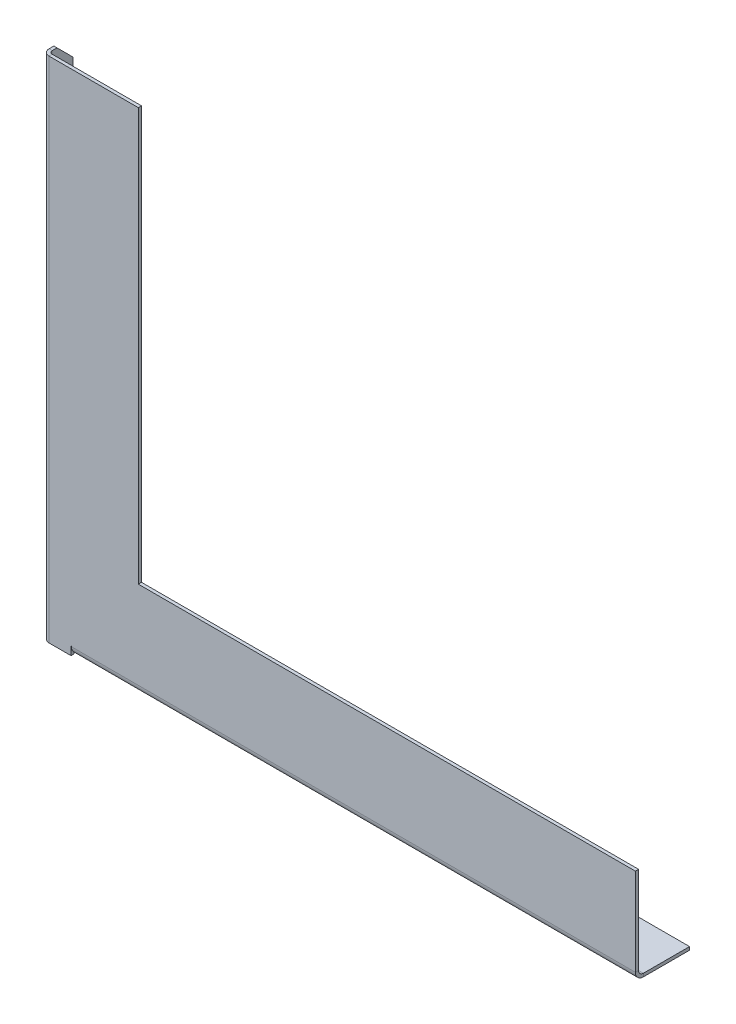
ISO-10303-21;
HEADER;
FILE_DESCRIPTION(('STEP AP214'),'2;1');
FILE_NAME('part.step','',(''),(''),'','','');
FILE_SCHEMA(('AUTOMOTIVE_DESIGN { 1 0 10303 214 1 1 1 1 }'));
ENDSEC;
DATA;
#1=APPLICATION_CONTEXT('core data for automotive mechanical design processes');
#2=APPLICATION_PROTOCOL_DEFINITION('international standard','automotive_design',2000,#1);
#3=PRODUCT_CONTEXT('',#1,'mechanical');
#4=PRODUCT('Part','Part','',(#3));
#5=PRODUCT_RELATED_PRODUCT_CATEGORY('part','',(#4));
#6=PRODUCT_DEFINITION_FORMATION('','',#4);
#7=PRODUCT_DEFINITION_CONTEXT('part definition',#1,'design');
#8=PRODUCT_DEFINITION('design','',#6,#7);
#9=PRODUCT_DEFINITION_SHAPE('','',#8);
#10=(LENGTH_UNIT() NAMED_UNIT(*) SI_UNIT(.MILLI.,.METRE.));
#11=(NAMED_UNIT(*) PLANE_ANGLE_UNIT() SI_UNIT($,.RADIAN.));
#12=(NAMED_UNIT(*) SI_UNIT($,.STERADIAN.) SOLID_ANGLE_UNIT());
#13=UNCERTAINTY_MEASURE_WITH_UNIT(LENGTH_MEASURE(1.E-05),#10,'distance_accuracy_value','');
#14=(GEOMETRIC_REPRESENTATION_CONTEXT(3) GLOBAL_UNCERTAINTY_ASSIGNED_CONTEXT((#13)) GLOBAL_UNIT_ASSIGNED_CONTEXT((#10,
#11,#12)) REPRESENTATION_CONTEXT('',''));
#15=CARTESIAN_POINT('',(0.,0.,0.));
#16=DIRECTION('',(0.,0.,1.));
#17=DIRECTION('',(1.,0.,0.));
#18=AXIS2_PLACEMENT_3D('',#15,#16,#17);
#19=CARTESIAN_POINT('',(257.171566449305,-275.679426827861,2.));
#20=DIRECTION('',(0.,1.,0.));
#21=DIRECTION('',(-1.,0.,0.));
#22=AXIS2_PLACEMENT_3D('',#19,#20,#21);
#23=PLANE('',#22);
#24=DIRECTION('',(0.,0.,1.));
#25=VECTOR('',#24,1.);
#26=CARTESIAN_POINT('',(-110.828433550695,-275.679426827861,0.));
#27=LINE('',#26,#25);
#28=CARTESIAN_POINT('',(-110.828433550695,-275.679426827861,0.));
#29=VERTEX_POINT('',#28);
#30=CARTESIAN_POINT('',(-110.828433550695,-275.679426827861,2.00000003878957));
#31=VERTEX_POINT('',#30);
#32=EDGE_CURVE('E13',#29,#31,#27,.T.);
#33=ORIENTED_EDGE('',*,*,#32,.F.);
#34=DIRECTION('',(1.,0.,0.));
#35=VECTOR('',#34,1.);
#36=CARTESIAN_POINT('',(257.171566449305,-275.679426827861,0.));
#37=LINE('',#36,#35);
#38=CARTESIAN_POINT('',(-97.0284335506954,-275.679426827861,0.));
#39=VERTEX_POINT('',#38);
#40=EDGE_CURVE('E87',#29,#39,#37,.T.);
#41=ORIENTED_EDGE('',*,*,#40,.T.);
#42=DIRECTION('',(0.,0.,1.));
#43=VECTOR('',#42,1.);
#44=CARTESIAN_POINT('',(-97.0284335506954,-275.679426827861,0.));
#45=LINE('',#44,#43);
#46=CARTESIAN_POINT('',(-97.0284335506954,-275.679426827861,2.));
#47=VERTEX_POINT('',#46);
#48=EDGE_CURVE('E310',#39,#47,#45,.T.);
#49=ORIENTED_EDGE('',*,*,#48,.T.);
#50=DIRECTION('',(1.,0.,0.));
#51=VECTOR('',#50,1.);
#52=CARTESIAN_POINT('',(257.171566449305,-275.679426827861,2.));
#53=LINE('',#52,#51);
#54=EDGE_CURVE('E329',#31,#47,#53,.T.);
#55=ORIENTED_EDGE('',*,*,#54,.F.);
#56=EDGE_LOOP('',(#33,#41,#49,#55));
#57=FACE_BOUND('',#56,.T.);
#58=ADVANCED_FACE('F73',(#57),#23,.F.);
#59=CARTESIAN_POINT('',(-114.828433550695,43.3205731721392,2.));
#60=DIRECTION('',(0.,0.,-1.));
#61=DIRECTION('',(-1.,0.,0.));
#62=AXIS2_PLACEMENT_3D('',#59,#60,#61);
#63=PLANE('',#62);
#64=DIRECTION('',(0.,-1.,0.));
#65=VECTOR('',#64,1.);
#66=CARTESIAN_POINT('',(-110.828433550695,43.3205731721392,2.00000000000001));
#67=LINE('',#66,#65);
#68=CARTESIAN_POINT('',(-110.828433550695,43.3205731721392,2.00000000000001));
#69=VERTEX_POINT('',#68);
#70=EDGE_CURVE('E366',#69,#31,#67,.T.);
#71=ORIENTED_EDGE('',*,*,#70,.T.);
#72=ORIENTED_EDGE('',*,*,#54,.T.);
#73=DIRECTION('',(0.,-1.,0.));
#74=VECTOR('',#73,1.);
#75=CARTESIAN_POINT('',(-97.0284335506963,43.3205731721392,2.));
#76=LINE('',#75,#74);
#77=CARTESIAN_POINT('',(-97.0284335506954,-270.479426827861,2.));
#78=VERTEX_POINT('',#77);
#79=EDGE_CURVE('E326',#78,#47,#76,.T.);
#80=ORIENTED_EDGE('',*,*,#79,.F.);
#81=DIRECTION('',(-1.,0.,0.));
#82=VECTOR('',#81,1.);
#83=CARTESIAN_POINT('',(-114.828433550695,-270.479426827861,2.));
#84=LINE('',#83,#82);
#85=CARTESIAN_POINT('',(-96.8284335506954,-270.479426827861,2.));
#86=VERTEX_POINT('',#85);
#87=EDGE_CURVE('E324',#86,#78,#84,.T.);
#88=ORIENTED_EDGE('',*,*,#87,.F.);
#89=DIRECTION('',(0.,1.,0.));
#90=VECTOR('',#89,1.);
#91=CARTESIAN_POINT('',(-96.8284335506954,43.3205731721392,2.));
#92=LINE('',#91,#90);
#93=CARTESIAN_POINT('',(-96.8284335506954,-270.679426827861,1.99999999999993));
#94=VERTEX_POINT('',#93);
#95=EDGE_CURVE('E309',#94,#86,#92,.T.);
#96=ORIENTED_EDGE('',*,*,#95,.F.);
#97=DIRECTION('',(1.,0.,0.));
#98=VECTOR('',#97,1.);
#99=CARTESIAN_POINT('',(-96.8284335506954,-270.679426827861,1.99999999999993));
#100=LINE('',#99,#98);
#101=CARTESIAN_POINT('',(257.171566449305,-270.679426827861,2.0000000947368));
#102=VERTEX_POINT('',#101);
#103=EDGE_CURVE('E355',#94,#102,#100,.T.);
#104=ORIENTED_EDGE('',*,*,#103,.T.);
#105=DIRECTION('',(0.,1.,0.));
#106=VECTOR('',#105,1.);
#107=CARTESIAN_POINT('',(257.171566449305,-215.679426827861,2.));
#108=LINE('',#107,#106);
#109=CARTESIAN_POINT('',(257.171566449305,-215.679426827861,2.));
#110=VERTEX_POINT('',#109);
#111=EDGE_CURVE('E331',#102,#110,#108,.T.);
#112=ORIENTED_EDGE('',*,*,#111,.T.);
#113=DIRECTION('',(-1.,0.,0.));
#114=VECTOR('',#113,1.);
#115=CARTESIAN_POINT('',(-54.8284335506954,-215.679426827861,2.));
#116=LINE('',#115,#114);
#117=CARTESIAN_POINT('',(-54.8284335506954,-215.679426827861,2.));
#118=VERTEX_POINT('',#117);
#119=EDGE_CURVE('E333',#110,#118,#116,.T.);
#120=ORIENTED_EDGE('',*,*,#119,.T.);
#121=DIRECTION('',(0.,1.,0.));
#122=VECTOR('',#121,1.);
#123=CARTESIAN_POINT('',(-54.8284335506954,43.3205731721392,2.));
#124=LINE('',#123,#122);
#125=CARTESIAN_POINT('',(-54.8284335506954,43.3205731721392,2.));
#126=VERTEX_POINT('',#125);
#127=EDGE_CURVE('E335',#118,#126,#124,.T.);
#128=ORIENTED_EDGE('',*,*,#127,.T.);
#129=DIRECTION('',(-1.,0.,0.));
#130=VECTOR('',#129,1.);
#131=CARTESIAN_POINT('',(-114.828433550695,43.3205731721392,2.));
#132=LINE('',#131,#130);
#133=EDGE_CURVE('E337',#126,#69,#132,.T.);
#134=ORIENTED_EDGE('',*,*,#133,.T.);
#135=EDGE_LOOP('',(#71,#72,#80,#88,#96,#104,#112,#120,#128,#134));
#136=FACE_BOUND('',#135,.T.);
#137=ADVANCED_FACE('F397',(#136),#63,.F.);
#138=CARTESIAN_POINT('',(-114.828433550695,43.3205731721392,0.));
#139=DIRECTION('',(0.,0.,-1.));
#140=DIRECTION('',(-1.,0.,0.));
#141=AXIS2_PLACEMENT_3D('',#138,#139,#140);
#142=PLANE('',#141);
#143=ORIENTED_EDGE('',*,*,#40,.F.);
#144=DIRECTION('',(0.,-1.,0.));
#145=VECTOR('',#144,1.);
#146=CARTESIAN_POINT('',(-110.828433550695,43.3205731721392,0.));
#147=LINE('',#146,#145);
#148=CARTESIAN_POINT('',(-110.828433550695,43.3205731721392,0.));
#149=VERTEX_POINT('',#148);
#150=EDGE_CURVE('E80',#149,#29,#147,.T.);
#151=ORIENTED_EDGE('',*,*,#150,.F.);
#152=DIRECTION('',(-1.,0.,0.));
#153=VECTOR('',#152,1.);
#154=CARTESIAN_POINT('',(-114.828433550695,43.3205731721392,0.));
#155=LINE('',#154,#153);
#156=CARTESIAN_POINT('',(-54.8284335506954,43.3205731721392,0.));
#157=VERTEX_POINT('',#156);
#158=EDGE_CURVE('E95',#157,#149,#155,.T.);
#159=ORIENTED_EDGE('',*,*,#158,.F.);
#160=DIRECTION('',(0.,1.,0.));
#161=VECTOR('',#160,1.);
#162=CARTESIAN_POINT('',(-54.8284335506954,43.3205731721392,0.));
#163=LINE('',#162,#161);
#164=CARTESIAN_POINT('',(-54.8284335506954,-215.679426827861,0.));
#165=VERTEX_POINT('',#164);
#166=EDGE_CURVE('E345',#165,#157,#163,.T.);
#167=ORIENTED_EDGE('',*,*,#166,.F.);
#168=DIRECTION('',(-1.,0.,0.));
#169=VECTOR('',#168,1.);
#170=CARTESIAN_POINT('',(-54.8284335506954,-215.679426827861,0.));
#171=LINE('',#170,#169);
#172=CARTESIAN_POINT('',(257.171566449305,-215.679426827861,0.));
#173=VERTEX_POINT('',#172);
#174=EDGE_CURVE('E343',#173,#165,#171,.T.);
#175=ORIENTED_EDGE('',*,*,#174,.F.);
#176=DIRECTION('',(0.,1.,0.));
#177=VECTOR('',#176,1.);
#178=CARTESIAN_POINT('',(257.171566449305,-215.679426827861,0.));
#179=LINE('',#178,#177);
#180=CARTESIAN_POINT('',(257.171566449305,-270.679426827861,0.));
#181=VERTEX_POINT('',#180);
#182=EDGE_CURVE('E341',#181,#173,#179,.T.);
#183=ORIENTED_EDGE('',*,*,#182,.F.);
#184=DIRECTION('',(1.,0.,0.));
#185=VECTOR('',#184,1.);
#186=CARTESIAN_POINT('',(-96.8284335506954,-270.679426827861,0.));
#187=LINE('',#186,#185);
#188=CARTESIAN_POINT('',(-96.8284335506954,-270.679426827861,0.));
#189=VERTEX_POINT('',#188);
#190=EDGE_CURVE('E360',#189,#181,#187,.T.);
#191=ORIENTED_EDGE('',*,*,#190,.F.);
#192=DIRECTION('',(0.,-1.,0.));
#193=VECTOR('',#192,1.);
#194=CARTESIAN_POINT('',(-96.8284335506954,-270.479426827861,0.));
#195=LINE('',#194,#193);
#196=CARTESIAN_POINT('',(-96.8284335506954,-270.479426827861,0.));
#197=VERTEX_POINT('',#196);
#198=EDGE_CURVE('E315',#197,#189,#195,.T.);
#199=ORIENTED_EDGE('',*,*,#198,.F.);
#200=DIRECTION('',(1.,0.,0.));
#201=VECTOR('',#200,1.);
#202=CARTESIAN_POINT('',(-97.0284335506954,-270.479426827861,0.));
#203=LINE('',#202,#201);
#204=CARTESIAN_POINT('',(-97.0284335506954,-270.479426827861,0.));
#205=VERTEX_POINT('',#204);
#206=EDGE_CURVE('E311',#205,#197,#203,.T.);
#207=ORIENTED_EDGE('',*,*,#206,.F.);
#208=DIRECTION('',(0.,1.,0.));
#209=VECTOR('',#208,1.);
#210=CARTESIAN_POINT('',(-97.0284335506954,-275.679426827861,0.));
#211=LINE('',#210,#209);
#212=EDGE_CURVE('E306',#39,#205,#211,.T.);
#213=ORIENTED_EDGE('',*,*,#212,.F.);
#214=EDGE_LOOP('',(#143,#151,#159,#167,#175,#183,#191,#199,#207,#213));
#215=FACE_BOUND('',#214,.T.);
#216=ADVANCED_FACE('F404',(#215),#142,.T.);
#217=CARTESIAN_POINT('',(-114.828433550695,43.3205731721392,2.));
#218=DIRECTION('',(0.,-1.,0.));
#219=DIRECTION('',(0.,0.,-1.));
#220=AXIS2_PLACEMENT_3D('',#217,#218,#219);
#221=PLANE('',#220);
#222=DIRECTION('',(0.,0.,1.));
#223=VECTOR('',#222,1.);
#224=CARTESIAN_POINT('',(-110.828433550695,43.3205731721392,0.));
#225=LINE('',#224,#223);
#226=EDGE_CURVE('E368',#149,#69,#225,.T.);
#227=ORIENTED_EDGE('',*,*,#226,.T.);
#228=ORIENTED_EDGE('',*,*,#133,.F.);
#229=DIRECTION('',(0.,0.,-1.));
#230=VECTOR('',#229,1.);
#231=CARTESIAN_POINT('',(-54.8284335506954,43.3205731721392,2.));
#232=LINE('',#231,#230);
#233=EDGE_CURVE('E339',#126,#157,#232,.T.);
#234=ORIENTED_EDGE('',*,*,#233,.T.);
#235=ORIENTED_EDGE('',*,*,#158,.T.);
#236=EDGE_LOOP('',(#227,#228,#234,#235));
#237=FACE_BOUND('',#236,.T.);
#238=ADVANCED_FACE('F392',(#237),#221,.F.);
#239=CARTESIAN_POINT('',(257.171566449305,-215.679426827861,2.));
#240=DIRECTION('',(-1.,0.,0.));
#241=DIRECTION('',(0.,-1.,0.));
#242=AXIS2_PLACEMENT_3D('',#239,#240,#241);
#243=PLANE('',#242);
#244=DIRECTION('',(0.,0.,1.));
#245=VECTOR('',#244,1.);
#246=CARTESIAN_POINT('',(257.171566449305,-270.679426827861,0.));
#247=LINE('',#246,#245);
#248=EDGE_CURVE('E363',#181,#102,#247,.T.);
#249=ORIENTED_EDGE('',*,*,#248,.F.);
#250=ORIENTED_EDGE('',*,*,#182,.T.);
#251=DIRECTION('',(0.,0.,-1.));
#252=VECTOR('',#251,1.);
#253=CARTESIAN_POINT('',(257.171566449305,-215.679426827861,2.));
#254=LINE('',#253,#252);
#255=EDGE_CURVE('E352',#110,#173,#254,.T.);
#256=ORIENTED_EDGE('',*,*,#255,.F.);
#257=ORIENTED_EDGE('',*,*,#111,.F.);
#258=EDGE_LOOP('',(#249,#250,#256,#257));
#259=FACE_BOUND('',#258,.T.);
#260=ADVANCED_FACE('F470',(#259),#243,.F.);
#261=CARTESIAN_POINT('',(-54.8284335506954,-215.679426827861,2.));
#262=DIRECTION('',(0.,-1.,0.));
#263=DIRECTION('',(1.,0.,0.));
#264=AXIS2_PLACEMENT_3D('',#261,#262,#263);
#265=PLANE('',#264);
#266=ORIENTED_EDGE('',*,*,#174,.T.);
#267=DIRECTION('',(0.,0.,-1.));
#268=VECTOR('',#267,1.);
#269=CARTESIAN_POINT('',(-54.8284335506954,-215.679426827861,2.));
#270=LINE('',#269,#268);
#271=EDGE_CURVE('E349',#118,#165,#270,.T.);
#272=ORIENTED_EDGE('',*,*,#271,.F.);
#273=ORIENTED_EDGE('',*,*,#119,.F.);
#274=ORIENTED_EDGE('',*,*,#255,.T.);
#275=EDGE_LOOP('',(#266,#272,#273,#274));
#276=FACE_BOUND('',#275,.T.);
#277=ADVANCED_FACE('F474',(#276),#265,.F.);
#278=CARTESIAN_POINT('',(-54.8284335506954,43.3205731721392,2.));
#279=DIRECTION('',(-1.,0.,0.));
#280=DIRECTION('',(0.,-1.,0.));
#281=AXIS2_PLACEMENT_3D('',#278,#279,#280);
#282=PLANE('',#281);
#283=ORIENTED_EDGE('',*,*,#166,.T.);
#284=ORIENTED_EDGE('',*,*,#233,.F.);
#285=ORIENTED_EDGE('',*,*,#127,.F.);
#286=ORIENTED_EDGE('',*,*,#271,.T.);
#287=EDGE_LOOP('',(#283,#284,#285,#286));
#288=FACE_BOUND('',#287,.T.);
#289=ADVANCED_FACE('F471',(#288),#282,.F.);
#290=CARTESIAN_POINT('',(-97.0284335506954,-275.679426827861,0.));
#291=DIRECTION('',(1.,0.,0.));
#292=DIRECTION('',(0.,1.,0.));
#293=AXIS2_PLACEMENT_3D('',#290,#291,#292);
#294=PLANE('',#293);
#295=DIRECTION('',(0.,0.,1.));
#296=VECTOR('',#295,1.);
#297=CARTESIAN_POINT('',(-97.0284335506954,-270.479426827861,0.));
#298=LINE('',#297,#296);
#299=EDGE_CURVE('E314',#205,#78,#298,.T.);
#300=ORIENTED_EDGE('',*,*,#299,.T.);
#301=ORIENTED_EDGE('',*,*,#79,.T.);
#302=ORIENTED_EDGE('',*,*,#48,.F.);
#303=ORIENTED_EDGE('',*,*,#212,.T.);
#304=EDGE_LOOP('',(#300,#301,#302,#303));
#305=FACE_BOUND('',#304,.T.);
#306=ADVANCED_FACE('F402',(#305),#294,.T.);
#307=CARTESIAN_POINT('',(-97.0284335506954,-270.479426827861,0.));
#308=DIRECTION('',(0.,-1.,0.));
#309=DIRECTION('',(0.,0.,-1.));
#310=AXIS2_PLACEMENT_3D('',#307,#308,#309);
#311=PLANE('',#310);
#312=DIRECTION('',(0.,0.,1.));
#313=VECTOR('',#312,1.);
#314=CARTESIAN_POINT('',(-96.8284335506954,-270.479426827861,0.));
#315=LINE('',#314,#313);
#316=EDGE_CURVE('E301',#197,#86,#315,.T.);
#317=ORIENTED_EDGE('',*,*,#316,.T.);
#318=ORIENTED_EDGE('',*,*,#87,.T.);
#319=ORIENTED_EDGE('',*,*,#299,.F.);
#320=ORIENTED_EDGE('',*,*,#206,.T.);
#321=EDGE_LOOP('',(#317,#318,#319,#320));
#322=FACE_BOUND('',#321,.T.);
#323=ADVANCED_FACE('F408',(#322),#311,.T.);
#324=CARTESIAN_POINT('',(-96.8284335506954,-270.479426827861,0.));
#325=DIRECTION('',(-1.,0.,0.));
#326=DIRECTION('',(0.,0.,1.));
#327=AXIS2_PLACEMENT_3D('',#324,#325,#326);
#328=PLANE('',#327);
#329=DIRECTION('',(0.,0.,1.));
#330=VECTOR('',#329,1.);
#331=CARTESIAN_POINT('',(-96.8284335506954,-270.679426827861,0.));
#332=LINE('',#331,#330);
#333=EDGE_CURVE('E357',#189,#94,#332,.T.);
#334=ORIENTED_EDGE('',*,*,#333,.T.);
#335=ORIENTED_EDGE('',*,*,#95,.T.);
#336=ORIENTED_EDGE('',*,*,#316,.F.);
#337=ORIENTED_EDGE('',*,*,#198,.T.);
#338=EDGE_LOOP('',(#334,#335,#336,#337));
#339=FACE_BOUND('',#338,.T.);
#340=ADVANCED_FACE('F414',(#339),#328,.T.);
#341=CARTESIAN_POINT('',(257.171566449305,-270.679426827861,-3.00000018947378));
#342=DIRECTION('',(1.,0.,0.));
#343=DIRECTION('',(0.,0.,-1.));
#344=AXIS2_PLACEMENT_3D('',#341,#342,#343);
#345=PLANE('',#344);
#346=DIRECTION('',(0.,-1.,0.));
#347=VECTOR('',#346,1.);
#348=CARTESIAN_POINT('',(257.171566449305,-275.679426827861,-3.00000000000006));
#349=LINE('',#348,#347);
#350=CARTESIAN_POINT('',(257.171566449305,-273.679426827861,-3.00000000000006));
#351=VERTEX_POINT('',#350);
#352=CARTESIAN_POINT('',(257.171566449305,-275.679427017335,-3.00000000000006));
#353=VERTEX_POINT('',#352);
#354=EDGE_CURVE('E270',#351,#353,#349,.T.);
#355=ORIENTED_EDGE('',*,*,#354,.F.);
#356=CARTESIAN_POINT('',(257.171566449305,-270.679426827861,-3.00000000000007));
#357=DIRECTION('',(1.,0.,0.));
#358=DIRECTION('',(0.,0.,-1.));
#359=AXIS2_PLACEMENT_3D('',#356,#357,#358);
#360=CIRCLE('',#359,3.00000018947372);
#361=EDGE_CURVE('E266',#351,#181,#360,.F.);
#362=ORIENTED_EDGE('',*,*,#361,.T.);
#363=ORIENTED_EDGE('',*,*,#248,.T.);
#364=CARTESIAN_POINT('',(257.171566449305,-270.679426827861,-3.00000018947378));
#365=DIRECTION('',(-1.,0.,0.));
#366=DIRECTION('',(0.,0.,1.));
#367=AXIS2_PLACEMENT_3D('',#364,#365,#366);
#368=CIRCLE('',#367,5.00000028421058);
#369=EDGE_CURVE('E294',#353,#102,#368,.T.);
#370=ORIENTED_EDGE('',*,*,#369,.F.);
#371=EDGE_LOOP('',(#355,#362,#363,#370));
#372=FACE_BOUND('',#371,.T.);
#373=ADVANCED_FACE('F437',(#372),#345,.T.);
#374=CARTESIAN_POINT('',(-96.8284335506954,-270.679426827861,-3.00000018947378));
#375=DIRECTION('',(-1.,0.,0.));
#376=DIRECTION('',(0.,0.,1.));
#377=AXIS2_PLACEMENT_3D('',#374,#375,#376);
#378=PLANE('',#377);
#379=CARTESIAN_POINT('',(-96.8284335506954,-270.679426827861,-3.00000000000007));
#380=DIRECTION('',(1.,0.,0.));
#381=DIRECTION('',(0.,0.,-1.));
#382=AXIS2_PLACEMENT_3D('',#379,#380,#381);
#383=CIRCLE('',#382,3.00000018947372);
#384=CARTESIAN_POINT('',(-96.8284335506954,-273.679426827861,-3.00000000000006));
#385=VERTEX_POINT('',#384);
#386=EDGE_CURVE('E298',#189,#385,#383,.T.);
#387=ORIENTED_EDGE('',*,*,#386,.T.);
#388=DIRECTION('',(0.,-1.,0.));
#389=VECTOR('',#388,1.);
#390=CARTESIAN_POINT('',(-96.8284335506954,-273.679426827861,-3.00000000000006));
#391=LINE('',#390,#389);
#392=CARTESIAN_POINT('',(-96.8284335506954,-275.679426827861,-3.00000000000006));
#393=VERTEX_POINT('',#392);
#394=EDGE_CURVE('E286',#385,#393,#391,.T.);
#395=ORIENTED_EDGE('',*,*,#394,.T.);
#396=CARTESIAN_POINT('',(-96.8284335506954,-270.679426827861,-3.00000018947378));
#397=DIRECTION('',(1.,0.,0.));
#398=DIRECTION('',(0.,0.,-1.));
#399=AXIS2_PLACEMENT_3D('',#396,#397,#398);
#400=CIRCLE('',#399,5.00000028421058);
#401=EDGE_CURVE('E297',#94,#393,#400,.T.);
#402=ORIENTED_EDGE('',*,*,#401,.F.);
#403=ORIENTED_EDGE('',*,*,#333,.F.);
#404=EDGE_LOOP('',(#387,#395,#402,#403));
#405=FACE_BOUND('',#404,.T.);
#406=ADVANCED_FACE('F421',(#405),#378,.T.);
#407=CARTESIAN_POINT('',(-273.889838419405,-270.679426827861,-3.00000000000007));
#408=DIRECTION('',(1.,0.,0.));
#409=DIRECTION('',(0.,0.,-1.));
#410=AXIS2_PLACEMENT_3D('',#407,#408,#409);
#411=CYLINDRICAL_SURFACE('',#410,5.00000018947372);
#412=ORIENTED_EDGE('',*,*,#103,.F.);
#413=ORIENTED_EDGE('',*,*,#401,.T.);
#414=DIRECTION('',(1.,0.,0.));
#415=VECTOR('',#414,1.);
#416=CARTESIAN_POINT('',(257.171566449305,-275.679426827861,-3.00000000000006));
#417=LINE('',#416,#415);
#418=EDGE_CURVE('E257',#393,#353,#417,.T.);
#419=ORIENTED_EDGE('',*,*,#418,.T.);
#420=ORIENTED_EDGE('',*,*,#369,.T.);
#421=EDGE_LOOP('',(#412,#413,#419,#420));
#422=FACE_BOUND('',#421,.T.);
#423=ADVANCED_FACE('F419',(#422),#411,.T.);
#424=CARTESIAN_POINT('',(-273.889838419405,-270.679426827861,-3.00000000000007));
#425=DIRECTION('',(1.,0.,0.));
#426=DIRECTION('',(0.,0.,-1.));
#427=AXIS2_PLACEMENT_3D('',#424,#425,#426);
#428=CYLINDRICAL_SURFACE('',#427,3.00000018947372);
#429=ORIENTED_EDGE('',*,*,#190,.T.);
#430=ORIENTED_EDGE('',*,*,#361,.F.);
#431=DIRECTION('',(-1.,0.,0.));
#432=VECTOR('',#431,1.);
#433=CARTESIAN_POINT('',(257.171566449305,-273.679426827861,-3.00000000000006));
#434=LINE('',#433,#432);
#435=EDGE_CURVE('E289',#351,#385,#434,.T.);
#436=ORIENTED_EDGE('',*,*,#435,.T.);
#437=ORIENTED_EDGE('',*,*,#386,.F.);
#438=EDGE_LOOP('',(#429,#430,#436,#437));
#439=FACE_BOUND('',#438,.T.);
#440=ADVANCED_FACE('F430',(#439),#428,.F.);
#441=CARTESIAN_POINT('',(257.171566449305,-275.679426827861,-32.));
#442=DIRECTION('',(0.,0.,1.));
#443=DIRECTION('',(0.,-1.,0.));
#444=AXIS2_PLACEMENT_3D('',#441,#442,#443);
#445=PLANE('',#444);
#446=DIRECTION('',(-1.,0.,0.));
#447=VECTOR('',#446,1.);
#448=CARTESIAN_POINT('',(257.171566449305,-273.679426827861,-32.));
#449=LINE('',#448,#447);
#450=CARTESIAN_POINT('',(-96.8284335506954,-273.679426827861,-32.));
#451=VERTEX_POINT('',#450);
#452=CARTESIAN_POINT('',(257.171566449305,-273.679426827861,-32.));
#453=VERTEX_POINT('',#452);
#454=EDGE_CURVE('E284',#451,#453,#449,.F.);
#455=ORIENTED_EDGE('',*,*,#454,.T.);
#456=DIRECTION('',(0.,1.,0.));
#457=VECTOR('',#456,1.);
#458=CARTESIAN_POINT('',(257.171566449305,-275.679426827861,-32.));
#459=LINE('',#458,#457);
#460=CARTESIAN_POINT('',(257.171566449305,-275.679426827861,-32.));
#461=VERTEX_POINT('',#460);
#462=EDGE_CURVE('E267',#461,#453,#459,.T.);
#463=ORIENTED_EDGE('',*,*,#462,.F.);
#464=DIRECTION('',(1.,0.,0.));
#465=VECTOR('',#464,1.);
#466=CARTESIAN_POINT('',(257.171566449305,-275.679426827861,-32.));
#467=LINE('',#466,#465);
#468=CARTESIAN_POINT('',(-96.8284335506954,-275.679426827861,-32.));
#469=VERTEX_POINT('',#468);
#470=EDGE_CURVE('E277',#469,#461,#467,.T.);
#471=ORIENTED_EDGE('',*,*,#470,.F.);
#472=DIRECTION('',(0.,1.,0.));
#473=VECTOR('',#472,1.);
#474=CARTESIAN_POINT('',(-96.8284335506954,-275.679426827861,-32.));
#475=LINE('',#474,#473);
#476=EDGE_CURVE('E281',#469,#451,#475,.T.);
#477=ORIENTED_EDGE('',*,*,#476,.T.);
#478=EDGE_LOOP('',(#455,#463,#471,#477));
#479=FACE_BOUND('',#478,.T.);
#480=ADVANCED_FACE('F446',(#479),#445,.F.);
#481=CARTESIAN_POINT('',(257.171566449305,-275.679426827861,0.));
#482=DIRECTION('',(0.,1.,0.));
#483=DIRECTION('',(0.,0.,1.));
#484=AXIS2_PLACEMENT_3D('',#481,#482,#483);
#485=PLANE('',#484);
#486=ORIENTED_EDGE('',*,*,#418,.F.);
#487=DIRECTION('',(0.,0.,-1.));
#488=VECTOR('',#487,1.);
#489=CARTESIAN_POINT('',(-96.8284335506954,-275.679426827861,0.));
#490=LINE('',#489,#488);
#491=EDGE_CURVE('E279',#393,#469,#490,.T.);
#492=ORIENTED_EDGE('',*,*,#491,.T.);
#493=ORIENTED_EDGE('',*,*,#470,.T.);
#494=DIRECTION('',(0.,0.,1.));
#495=VECTOR('',#494,1.);
#496=CARTESIAN_POINT('',(257.171566449305,-275.679426827861,0.));
#497=LINE('',#496,#495);
#498=EDGE_CURVE('E274',#461,#353,#497,.T.);
#499=ORIENTED_EDGE('',*,*,#498,.T.);
#500=EDGE_LOOP('',(#486,#492,#493,#499));
#501=FACE_BOUND('',#500,.T.);
#502=ADVANCED_FACE('F442',(#501),#485,.F.);
#503=CARTESIAN_POINT('',(-96.8284335506954,-275.679426827861,-32.));
#504=DIRECTION('',(1.,0.,0.));
#505=DIRECTION('',(0.,1.,0.));
#506=AXIS2_PLACEMENT_3D('',#503,#504,#505);
#507=PLANE('',#506);
#508=ORIENTED_EDGE('',*,*,#394,.F.);
#509=DIRECTION('',(0.,0.,1.));
#510=VECTOR('',#509,1.);
#511=CARTESIAN_POINT('',(-96.8284335506954,-273.679426827861,-32.));
#512=LINE('',#511,#510);
#513=EDGE_CURVE('E272',#385,#451,#512,.F.);
#514=ORIENTED_EDGE('',*,*,#513,.T.);
#515=ORIENTED_EDGE('',*,*,#476,.F.);
#516=ORIENTED_EDGE('',*,*,#491,.F.);
#517=EDGE_LOOP('',(#508,#514,#515,#516));
#518=FACE_BOUND('',#517,.T.);
#519=ADVANCED_FACE('F425',(#518),#507,.F.);
#520=CARTESIAN_POINT('',(257.171566449305,-273.679426827861,0.));
#521=DIRECTION('',(0.,1.,0.));
#522=DIRECTION('',(0.,0.,1.));
#523=AXIS2_PLACEMENT_3D('',#520,#521,#522);
#524=PLANE('',#523);
#525=ORIENTED_EDGE('',*,*,#513,.F.);
#526=ORIENTED_EDGE('',*,*,#435,.F.);
#527=DIRECTION('',(0.,0.,-1.));
#528=VECTOR('',#527,1.);
#529=CARTESIAN_POINT('',(257.171566449305,-273.679426827861,0.));
#530=LINE('',#529,#528);
#531=EDGE_CURVE('E264',#453,#351,#530,.F.);
#532=ORIENTED_EDGE('',*,*,#531,.F.);
#533=ORIENTED_EDGE('',*,*,#454,.F.);
#534=EDGE_LOOP('',(#525,#526,#532,#533));
#535=FACE_BOUND('',#534,.T.);
#536=ADVANCED_FACE('F434',(#535),#524,.T.);
#537=CARTESIAN_POINT('',(257.171566449305,-275.679426827861,0.));
#538=DIRECTION('',(-1.,0.,0.));
#539=DIRECTION('',(0.,-1.,0.));
#540=AXIS2_PLACEMENT_3D('',#537,#538,#539);
#541=PLANE('',#540);
#542=ORIENTED_EDGE('',*,*,#354,.T.);
#543=ORIENTED_EDGE('',*,*,#498,.F.);
#544=ORIENTED_EDGE('',*,*,#462,.T.);
#545=ORIENTED_EDGE('',*,*,#531,.T.);
#546=EDGE_LOOP('',(#542,#543,#544,#545));
#547=FACE_BOUND('',#546,.T.);
#548=ADVANCED_FACE('F440',(#547),#541,.F.);
#549=CARTESIAN_POINT('',(-110.828433550695,-275.679426827861,-2.00000007757913));
#550=DIRECTION('',(0.,-1.,0.));
#551=DIRECTION('',(0.,0.,-1.));
#552=AXIS2_PLACEMENT_3D('',#549,#550,#551);
#553=PLANE('',#552);
#554=DIRECTION('',(-1.,0.,0.));
#555=VECTOR('',#554,1.);
#556=CARTESIAN_POINT('',(-114.828433550695,-275.679426827861,-2.00000000000003));
#557=LINE('',#556,#555);
#558=CARTESIAN_POINT('',(-112.828433550695,-275.679426827861,-2.00000000000003));
#559=VERTEX_POINT('',#558);
#560=CARTESIAN_POINT('',(-114.828433628275,-275.679426827861,-1.99999999999997));
#561=VERTEX_POINT('',#560);
#562=EDGE_CURVE('E216',#559,#561,#557,.T.);
#563=ORIENTED_EDGE('',*,*,#562,.F.);
#564=CARTESIAN_POINT('',(-110.828433550695,-275.679426827861,-1.99999999999999));
#565=DIRECTION('',(0.,-1.,0.));
#566=DIRECTION('',(0.,0.,-1.));
#567=AXIS2_PLACEMENT_3D('',#564,#565,#566);
#568=CIRCLE('',#567,2.00000007757913);
#569=EDGE_CURVE('E258',#559,#29,#568,.F.);
#570=ORIENTED_EDGE('',*,*,#569,.T.);
#571=ORIENTED_EDGE('',*,*,#32,.T.);
#572=CARTESIAN_POINT('',(-110.828433550695,-275.679426827861,-2.00000007757913));
#573=DIRECTION('',(0.,1.,0.));
#574=DIRECTION('',(0.,0.,1.));
#575=AXIS2_PLACEMENT_3D('',#572,#573,#574);
#576=CIRCLE('',#575,4.0000001163687);
#577=EDGE_CURVE('E250',#561,#31,#576,.T.);
#578=ORIENTED_EDGE('',*,*,#577,.F.);
#579=EDGE_LOOP('',(#563,#570,#571,#578));
#580=FACE_BOUND('',#579,.T.);
#581=ADVANCED_FACE('F377',(#580),#553,.T.);
#582=CARTESIAN_POINT('',(-110.828433550695,43.3205731721392,-2.00000007757913));
#583=DIRECTION('',(0.,1.,0.));
#584=DIRECTION('',(0.,0.,1.));
#585=AXIS2_PLACEMENT_3D('',#582,#583,#584);
#586=PLANE('',#585);
#587=CARTESIAN_POINT('',(-110.828433550695,43.3205731721392,-1.99999999999999));
#588=DIRECTION('',(0.,-1.,0.));
#589=DIRECTION('',(0.,0.,-1.));
#590=AXIS2_PLACEMENT_3D('',#587,#588,#589);
#591=CIRCLE('',#590,2.00000007757913);
#592=CARTESIAN_POINT('',(-112.828433550695,43.3205731721392,-2.00000000000003));
#593=VERTEX_POINT('',#592);
#594=EDGE_CURVE('E254',#149,#593,#591,.T.);
#595=ORIENTED_EDGE('',*,*,#594,.T.);
#596=DIRECTION('',(-1.,0.,0.));
#597=VECTOR('',#596,1.);
#598=CARTESIAN_POINT('',(-112.828433550695,43.3205731721392,-2.00000000000003));
#599=LINE('',#598,#597);
#600=CARTESIAN_POINT('',(-114.828433550695,43.3205731721392,-2.00000000000003));
#601=VERTEX_POINT('',#600);
#602=EDGE_CURVE('E224',#593,#601,#599,.T.);
#603=ORIENTED_EDGE('',*,*,#602,.T.);
#604=CARTESIAN_POINT('',(-110.828433550695,43.3205731721392,-2.00000007757913));
#605=DIRECTION('',(0.,-1.,0.));
#606=DIRECTION('',(0.,0.,-1.));
#607=AXIS2_PLACEMENT_3D('',#604,#605,#606);
#608=CIRCLE('',#607,4.0000001163687);
#609=EDGE_CURVE('E253',#69,#601,#608,.T.);
#610=ORIENTED_EDGE('',*,*,#609,.F.);
#611=ORIENTED_EDGE('',*,*,#226,.F.);
#612=EDGE_LOOP('',(#595,#603,#610,#611));
#613=FACE_BOUND('',#612,.T.);
#614=ADVANCED_FACE('F388',(#613),#586,.T.);
#615=CARTESIAN_POINT('',(-110.828433550695,202.861646718951,-1.99999999999999));
#616=DIRECTION('',(0.,-1.,0.));
#617=DIRECTION('',(0.,0.,-1.));
#618=AXIS2_PLACEMENT_3D('',#615,#616,#617);
#619=CYLINDRICAL_SURFACE('',#618,4.00000007757913);
#620=ORIENTED_EDGE('',*,*,#70,.F.);
#621=ORIENTED_EDGE('',*,*,#609,.T.);
#622=DIRECTION('',(0.,-1.,0.));
#623=VECTOR('',#622,1.);
#624=CARTESIAN_POINT('',(-114.828433550695,-275.679426827861,-2.00000000000003));
#625=LINE('',#624,#623);
#626=EDGE_CURVE('E247',#601,#561,#625,.T.);
#627=ORIENTED_EDGE('',*,*,#626,.T.);
#628=ORIENTED_EDGE('',*,*,#577,.T.);
#629=EDGE_LOOP('',(#620,#621,#627,#628));
#630=FACE_BOUND('',#629,.T.);
#631=ADVANCED_FACE('F394',(#630),#619,.T.);
#632=CARTESIAN_POINT('',(-110.828433550695,202.861646718951,-1.99999999999999));
#633=DIRECTION('',(0.,-1.,0.));
#634=DIRECTION('',(0.,0.,-1.));
#635=AXIS2_PLACEMENT_3D('',#632,#633,#634);
#636=CYLINDRICAL_SURFACE('',#635,2.00000007757913);
#637=ORIENTED_EDGE('',*,*,#150,.T.);
#638=ORIENTED_EDGE('',*,*,#569,.F.);
#639=DIRECTION('',(0.,1.,0.));
#640=VECTOR('',#639,1.);
#641=CARTESIAN_POINT('',(-112.828433550695,-275.679426827861,-2.00000000000003));
#642=LINE('',#641,#640);
#643=EDGE_CURVE('E245',#559,#593,#642,.T.);
#644=ORIENTED_EDGE('',*,*,#643,.T.);
#645=ORIENTED_EDGE('',*,*,#594,.F.);
#646=EDGE_LOOP('',(#637,#638,#644,#645));
#647=FACE_BOUND('',#646,.T.);
#648=ADVANCED_FACE('F373',(#647),#636,.F.);
#649=CARTESIAN_POINT('',(-114.828433550695,-275.679426827861,-15.));
#650=DIRECTION('',(0.,0.,1.));
#651=DIRECTION('',(1.,0.,0.));
#652=AXIS2_PLACEMENT_3D('',#649,#650,#651);
#653=PLANE('',#652);
#654=DIRECTION('',(0.,-1.,0.));
#655=VECTOR('',#654,1.);
#656=CARTESIAN_POINT('',(-114.828433550695,-275.679426827861,-15.));
#657=LINE('',#656,#655);
#658=CARTESIAN_POINT('',(-114.828433550695,33.3205731721391,-15.));
#659=VERTEX_POINT('',#658);
#660=CARTESIAN_POINT('',(-114.828433550695,-275.679426827861,-15.));
#661=VERTEX_POINT('',#660);
#662=EDGE_CURVE('E236',#659,#661,#657,.T.);
#663=ORIENTED_EDGE('',*,*,#662,.F.);
#664=DIRECTION('',(1.,0.,0.));
#665=VECTOR('',#664,1.);
#666=CARTESIAN_POINT('',(-114.828433550695,33.3205731721392,-15.));
#667=LINE('',#666,#665);
#668=CARTESIAN_POINT('',(-112.828433550695,33.3205731721391,-15.));
#669=VERTEX_POINT('',#668);
#670=EDGE_CURVE('E242',#659,#669,#667,.T.);
#671=ORIENTED_EDGE('',*,*,#670,.T.);
#672=DIRECTION('',(0.,1.,0.));
#673=VECTOR('',#672,1.);
#674=CARTESIAN_POINT('',(-112.828433550695,-275.679426827861,-15.));
#675=LINE('',#674,#673);
#676=CARTESIAN_POINT('',(-112.828433550695,-275.679426827861,-15.));
#677=VERTEX_POINT('',#676);
#678=EDGE_CURVE('E211',#669,#677,#675,.F.);
#679=ORIENTED_EDGE('',*,*,#678,.T.);
#680=DIRECTION('',(1.,0.,0.));
#681=VECTOR('',#680,1.);
#682=CARTESIAN_POINT('',(-114.828433550695,-275.679426827861,-15.));
#683=LINE('',#682,#681);
#684=EDGE_CURVE('E381',#661,#677,#683,.T.);
#685=ORIENTED_EDGE('',*,*,#684,.F.);
#686=EDGE_LOOP('',(#663,#671,#679,#685));
#687=FACE_BOUND('',#686,.T.);
#688=ADVANCED_FACE('F609',(#687),#653,.F.);
#689=CARTESIAN_POINT('',(-114.828433550695,33.3205731721392,-15.));
#690=DIRECTION('',(0.,-0.707106781186546,0.707106781186548));
#691=DIRECTION('',(0.,0.707106781186549,0.707106781186547));
#692=AXIS2_PLACEMENT_3D('',#689,#690,#691);
#693=PLANE('',#692);
#694=DIRECTION('',(0.,0.707106781186549,0.707106781186547));
#695=VECTOR('',#694,1.);
#696=CARTESIAN_POINT('',(-114.828433550695,33.3205731721392,-15.));
#697=LINE('',#696,#695);
#698=CARTESIAN_POINT('',(-114.828433550695,43.3205731721392,-5.00000000000005));
#699=VERTEX_POINT('',#698);
#700=EDGE_CURVE('E230',#699,#659,#697,.F.);
#701=ORIENTED_EDGE('',*,*,#700,.F.);
#702=DIRECTION('',(-1.,0.,0.));
#703=VECTOR('',#702,1.);
#704=CARTESIAN_POINT('',(-114.828433550695,43.3205731721392,-5.00000000000005));
#705=LINE('',#704,#703);
#706=CARTESIAN_POINT('',(-112.828433550695,43.3205731721392,-5.00000000000005));
#707=VERTEX_POINT('',#706);
#708=EDGE_CURVE('E217',#707,#699,#705,.T.);
#709=ORIENTED_EDGE('',*,*,#708,.F.);
#710=DIRECTION('',(0.,-0.707106781186549,-0.707106781186547));
#711=VECTOR('',#710,1.);
#712=CARTESIAN_POINT('',(-112.828433550696,-113.679426827861,-162.));
#713=LINE('',#712,#711);
#714=EDGE_CURVE('E204',#669,#707,#713,.F.);
#715=ORIENTED_EDGE('',*,*,#714,.F.);
#716=ORIENTED_EDGE('',*,*,#670,.F.);
#717=EDGE_LOOP('',(#701,#709,#715,#716));
#718=FACE_BOUND('',#717,.T.);
#719=ADVANCED_FACE('F229',(#718),#693,.F.);
#720=CARTESIAN_POINT('',(-114.828433550695,-275.679426827861,0.));
#721=DIRECTION('',(1.,0.,0.));
#722=DIRECTION('',(0.,0.,-1.));
#723=AXIS2_PLACEMENT_3D('',#720,#721,#722);
#724=PLANE('',#723);
#725=DIRECTION('',(0.,0.,-1.));
#726=VECTOR('',#725,1.);
#727=CARTESIAN_POINT('',(-114.828433550695,43.3205731721392,0.));
#728=LINE('',#727,#726);
#729=EDGE_CURVE('E239',#601,#699,#728,.T.);
#730=ORIENTED_EDGE('',*,*,#729,.T.);
#731=ORIENTED_EDGE('',*,*,#700,.T.);
#732=ORIENTED_EDGE('',*,*,#662,.T.);
#733=DIRECTION('',(0.,0.,1.));
#734=VECTOR('',#733,1.);
#735=CARTESIAN_POINT('',(-114.828433550695,-275.679426827861,0.));
#736=LINE('',#735,#734);
#737=EDGE_CURVE('E226',#661,#561,#736,.T.);
#738=ORIENTED_EDGE('',*,*,#737,.T.);
#739=ORIENTED_EDGE('',*,*,#626,.F.);
#740=EDGE_LOOP('',(#730,#731,#732,#738,#739));
#741=FACE_BOUND('',#740,.T.);
#742=ADVANCED_FACE('F628',(#741),#724,.F.);
#743=CARTESIAN_POINT('',(-114.828433550695,43.3205731721392,-15.));
#744=DIRECTION('',(0.,-1.,0.));
#745=DIRECTION('',(0.,0.,-1.));
#746=AXIS2_PLACEMENT_3D('',#743,#744,#745);
#747=PLANE('',#746);
#748=DIRECTION('',(0.,0.,1.));
#749=VECTOR('',#748,1.);
#750=CARTESIAN_POINT('',(-112.828433550695,43.3205731721392,-15.));
#751=LINE('',#750,#749);
#752=EDGE_CURVE('E208',#593,#707,#751,.F.);
#753=ORIENTED_EDGE('',*,*,#752,.T.);
#754=ORIENTED_EDGE('',*,*,#708,.T.);
#755=ORIENTED_EDGE('',*,*,#729,.F.);
#756=ORIENTED_EDGE('',*,*,#602,.F.);
#757=EDGE_LOOP('',(#753,#754,#755,#756));
#758=FACE_BOUND('',#757,.T.);
#759=ADVANCED_FACE('F220',(#758),#747,.F.);
#760=CARTESIAN_POINT('',(-112.828433550695,-275.679426827861,0.));
#761=DIRECTION('',(1.,0.,0.));
#762=DIRECTION('',(0.,0.,-1.));
#763=AXIS2_PLACEMENT_3D('',#760,#761,#762);
#764=PLANE('',#763);
#765=ORIENTED_EDGE('',*,*,#678,.F.);
#766=ORIENTED_EDGE('',*,*,#714,.T.);
#767=ORIENTED_EDGE('',*,*,#752,.F.);
#768=ORIENTED_EDGE('',*,*,#643,.F.);
#769=DIRECTION('',(0.,0.,-1.));
#770=VECTOR('',#769,1.);
#771=CARTESIAN_POINT('',(-112.828433550695,-275.679426827861,0.));
#772=LINE('',#771,#770);
#773=EDGE_CURVE('E261',#677,#559,#772,.F.);
#774=ORIENTED_EDGE('',*,*,#773,.F.);
#775=EDGE_LOOP('',(#765,#766,#767,#768,#774));
#776=FACE_BOUND('',#775,.T.);
#777=ADVANCED_FACE('F206',(#776),#764,.T.);
#778=CARTESIAN_POINT('',(-114.828433550695,-275.679426827861,0.));
#779=DIRECTION('',(0.,1.,0.));
#780=DIRECTION('',(0.,0.,1.));
#781=AXIS2_PLACEMENT_3D('',#778,#779,#780);
#782=PLANE('',#781);
#783=ORIENTED_EDGE('',*,*,#562,.T.);
#784=ORIENTED_EDGE('',*,*,#737,.F.);
#785=ORIENTED_EDGE('',*,*,#684,.T.);
#786=ORIENTED_EDGE('',*,*,#773,.T.);
#787=EDGE_LOOP('',(#783,#784,#785,#786));
#788=FACE_BOUND('',#787,.T.);
#789=ADVANCED_FACE('F385',(#788),#782,.F.);
#790=CLOSED_SHELL('',(#58,#137,#216,#238,#260,#277,#289,#306,#323,#340,#373,#406,#423,#440,#480,
#502,#519,#536,#548,#581,#614,#631,#648,#688,#719,#742,#759,#777,#789));
#791=MANIFOLD_SOLID_BREP('B2',#790);
#792=ADVANCED_BREP_SHAPE_REPRESENTATION('',(#18,#791),#14);
#793=SHAPE_DEFINITION_REPRESENTATION(#9,#792);
ENDSEC;
END-ISO-10303-21;
